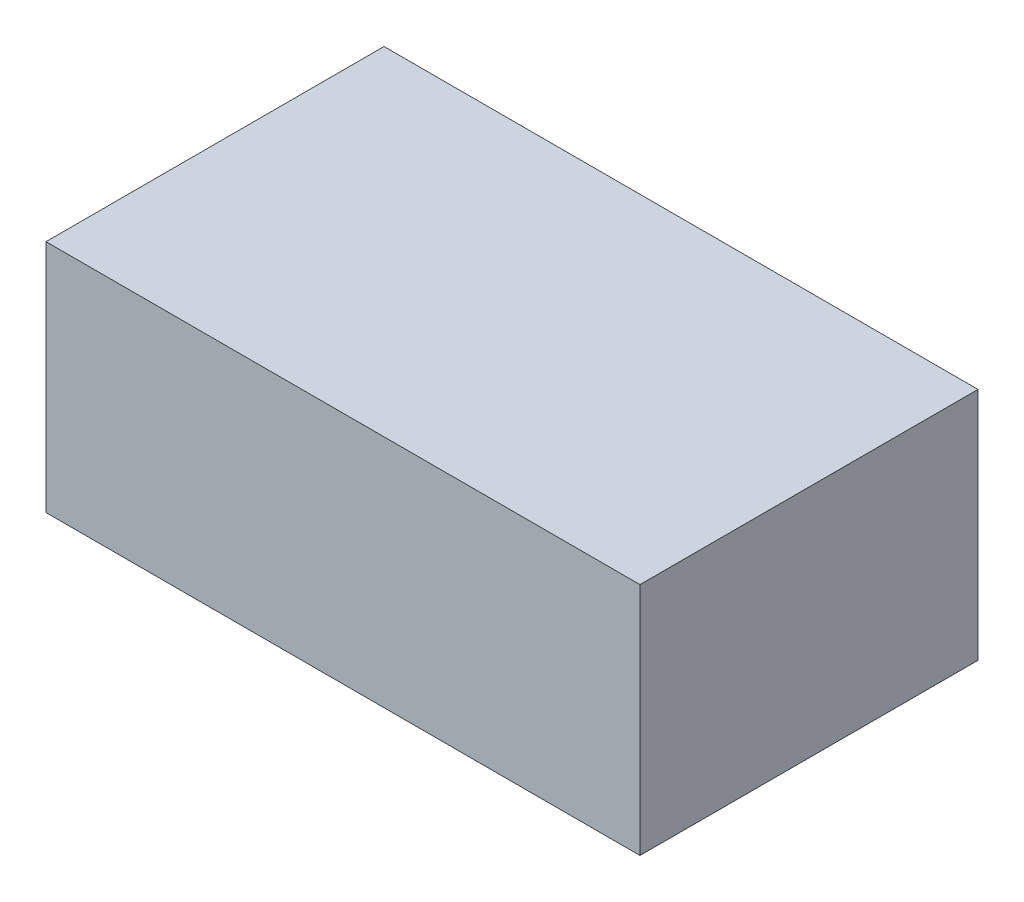
ISO-10303-21;
HEADER;
FILE_DESCRIPTION(('STEP AP214'),'2;1');
FILE_NAME('part.step','',(''),(''),'','','');
FILE_SCHEMA(('AUTOMOTIVE_DESIGN { 1 0 10303 214 1 1 1 1 }'));
ENDSEC;
DATA;
#1=APPLICATION_CONTEXT('core data for automotive mechanical design processes');
#2=APPLICATION_PROTOCOL_DEFINITION('international standard','automotive_design',2000,#1);
#3=PRODUCT_CONTEXT('',#1,'mechanical');
#4=PRODUCT('Part','Part','',(#3));
#5=PRODUCT_RELATED_PRODUCT_CATEGORY('part','',(#4));
#6=PRODUCT_DEFINITION_FORMATION('','',#4);
#7=PRODUCT_DEFINITION_CONTEXT('part definition',#1,'design');
#8=PRODUCT_DEFINITION('design','',#6,#7);
#9=PRODUCT_DEFINITION_SHAPE('','',#8);
#10=(LENGTH_UNIT() NAMED_UNIT(*) SI_UNIT(.MILLI.,.METRE.));
#11=(NAMED_UNIT(*) PLANE_ANGLE_UNIT() SI_UNIT($,.RADIAN.));
#12=(NAMED_UNIT(*) SI_UNIT($,.STERADIAN.) SOLID_ANGLE_UNIT());
#13=UNCERTAINTY_MEASURE_WITH_UNIT(LENGTH_MEASURE(1.E-05),#10,'distance_accuracy_value','');
#14=(GEOMETRIC_REPRESENTATION_CONTEXT(3) GLOBAL_UNCERTAINTY_ASSIGNED_CONTEXT((#13)) GLOBAL_UNIT_ASSIGNED_CONTEXT((#10,
#11,#12)) REPRESENTATION_CONTEXT('',''));
#15=CARTESIAN_POINT('',(0.,0.,0.));
#16=DIRECTION('',(0.,0.,1.));
#17=DIRECTION('',(1.,0.,0.));
#18=AXIS2_PLACEMENT_3D('',#15,#16,#17);
#19=CARTESIAN_POINT('',(0.,22.,0.));
#20=DIRECTION('',(1.,0.,0.));
#21=DIRECTION('',(0.,0.,-1.));
#22=AXIS2_PLACEMENT_3D('',#19,#20,#21);
#23=PLANE('',#22);
#24=DIRECTION('',(0.,0.,1.));
#25=VECTOR('',#24,1.);
#26=CARTESIAN_POINT('',(0.,0.,0.));
#27=LINE('',#26,#25);
#28=CARTESIAN_POINT('',(0.,0.,-31.7));
#29=VERTEX_POINT('',#28);
#30=CARTESIAN_POINT('',(0.,0.,0.));
#31=VERTEX_POINT('',#30);
#32=EDGE_CURVE('E158',#29,#31,#27,.T.);
#33=ORIENTED_EDGE('',*,*,#32,.T.);
#34=DIRECTION('',(0.,-1.,0.));
#35=VECTOR('',#34,1.);
#36=CARTESIAN_POINT('',(0.,22.,0.));
#37=LINE('',#36,#35);
#38=CARTESIAN_POINT('',(0.,22.,0.));
#39=VERTEX_POINT('',#38);
#40=EDGE_CURVE('E11',#39,#31,#37,.T.);
#41=ORIENTED_EDGE('',*,*,#40,.F.);
#42=DIRECTION('',(0.,0.,1.));
#43=VECTOR('',#42,1.);
#44=CARTESIAN_POINT('',(0.,22.,0.));
#45=LINE('',#44,#43);
#46=CARTESIAN_POINT('',(0.,22.,-31.7));
#47=VERTEX_POINT('',#46);
#48=EDGE_CURVE('E164',#47,#39,#45,.T.);
#49=ORIENTED_EDGE('',*,*,#48,.F.);
#50=DIRECTION('',(0.,-1.,0.));
#51=VECTOR('',#50,1.);
#52=CARTESIAN_POINT('',(0.,22.,-31.7));
#53=LINE('',#52,#51);
#54=EDGE_CURVE('E174',#47,#29,#53,.T.);
#55=ORIENTED_EDGE('',*,*,#54,.T.);
#56=EDGE_LOOP('',(#33,#41,#49,#55));
#57=FACE_BOUND('',#56,.T.);
#58=ADVANCED_FACE('F39',(#57),#23,.F.);
#59=CARTESIAN_POINT('',(0.,22.,0.));
#60=DIRECTION('',(0.,0.,-1.));
#61=DIRECTION('',(-1.,0.,0.));
#62=AXIS2_PLACEMENT_3D('',#59,#60,#61);
#63=PLANE('',#62);
#64=DIRECTION('',(1.,0.,0.));
#65=VECTOR('',#64,1.);
#66=CARTESIAN_POINT('',(0.,0.,0.));
#67=LINE('',#66,#65);
#68=CARTESIAN_POINT('',(55.7,0.,0.));
#69=VERTEX_POINT('',#68);
#70=EDGE_CURVE('E178',#31,#69,#67,.T.);
#71=ORIENTED_EDGE('',*,*,#70,.T.);
#72=DIRECTION('',(0.,-1.,0.));
#73=VECTOR('',#72,1.);
#74=CARTESIAN_POINT('',(55.7,22.,0.));
#75=LINE('',#74,#73);
#76=CARTESIAN_POINT('',(55.7,22.,0.));
#77=VERTEX_POINT('',#76);
#78=EDGE_CURVE('E47',#77,#69,#75,.T.);
#79=ORIENTED_EDGE('',*,*,#78,.F.);
#80=DIRECTION('',(1.,0.,0.));
#81=VECTOR('',#80,1.);
#82=CARTESIAN_POINT('',(0.,22.,0.));
#83=LINE('',#82,#81);
#84=EDGE_CURVE('E91',#39,#77,#83,.T.);
#85=ORIENTED_EDGE('',*,*,#84,.F.);
#86=ORIENTED_EDGE('',*,*,#40,.T.);
#87=EDGE_LOOP('',(#71,#79,#85,#86));
#88=FACE_BOUND('',#87,.T.);
#89=ADVANCED_FACE('F212',(#88),#63,.F.);
#90=CARTESIAN_POINT('',(55.7,22.,0.));
#91=DIRECTION('',(-1.,0.,0.));
#92=DIRECTION('',(0.,0.,1.));
#93=AXIS2_PLACEMENT_3D('',#90,#91,#92);
#94=PLANE('',#93);
#95=DIRECTION('',(0.,0.,-1.));
#96=VECTOR('',#95,1.);
#97=CARTESIAN_POINT('',(55.7,0.,0.));
#98=LINE('',#97,#96);
#99=CARTESIAN_POINT('',(55.7,0.,-31.7));
#100=VERTEX_POINT('',#99);
#101=EDGE_CURVE('E181',#69,#100,#98,.T.);
#102=ORIENTED_EDGE('',*,*,#101,.T.);
#103=DIRECTION('',(0.,-1.,0.));
#104=VECTOR('',#103,1.);
#105=CARTESIAN_POINT('',(55.7,22.,-31.7));
#106=LINE('',#105,#104);
#107=CARTESIAN_POINT('',(55.7,22.,-31.7));
#108=VERTEX_POINT('',#107);
#109=EDGE_CURVE('E188',#108,#100,#106,.T.);
#110=ORIENTED_EDGE('',*,*,#109,.F.);
#111=DIRECTION('',(0.,0.,-1.));
#112=VECTOR('',#111,1.);
#113=CARTESIAN_POINT('',(55.7,22.,0.));
#114=LINE('',#113,#112);
#115=EDGE_CURVE('E169',#77,#108,#114,.T.);
#116=ORIENTED_EDGE('',*,*,#115,.F.);
#117=ORIENTED_EDGE('',*,*,#78,.T.);
#118=EDGE_LOOP('',(#102,#110,#116,#117));
#119=FACE_BOUND('',#118,.T.);
#120=ADVANCED_FACE('F195',(#119),#94,.F.);
#121=CARTESIAN_POINT('',(0.,22.,-31.7));
#122=DIRECTION('',(0.,0.,1.));
#123=DIRECTION('',(1.,0.,0.));
#124=AXIS2_PLACEMENT_3D('',#121,#122,#123);
#125=PLANE('',#124);
#126=DIRECTION('',(-1.,0.,0.));
#127=VECTOR('',#126,1.);
#128=CARTESIAN_POINT('',(0.,0.,-31.7));
#129=LINE('',#128,#127);
#130=EDGE_CURVE('E84',#100,#29,#129,.T.);
#131=ORIENTED_EDGE('',*,*,#130,.T.);
#132=ORIENTED_EDGE('',*,*,#54,.F.);
#133=DIRECTION('',(-1.,0.,0.));
#134=VECTOR('',#133,1.);
#135=CARTESIAN_POINT('',(0.,22.,-31.7));
#136=LINE('',#135,#134);
#137=EDGE_CURVE('E63',#108,#47,#136,.T.);
#138=ORIENTED_EDGE('',*,*,#137,.F.);
#139=ORIENTED_EDGE('',*,*,#109,.T.);
#140=EDGE_LOOP('',(#131,#132,#138,#139));
#141=FACE_BOUND('',#140,.T.);
#142=ADVANCED_FACE('F203',(#141),#125,.F.);
#143=CARTESIAN_POINT('',(0.,22.,0.));
#144=DIRECTION('',(0.,-1.,0.));
#145=DIRECTION('',(0.,0.,-1.));
#146=AXIS2_PLACEMENT_3D('',#143,#144,#145);
#147=PLANE('',#146);
#148=ORIENTED_EDGE('',*,*,#48,.T.);
#149=ORIENTED_EDGE('',*,*,#84,.T.);
#150=ORIENTED_EDGE('',*,*,#115,.T.);
#151=ORIENTED_EDGE('',*,*,#137,.T.);
#152=EDGE_LOOP('',(#148,#149,#150,#151));
#153=FACE_BOUND('',#152,.T.);
#154=ADVANCED_FACE('F205',(#153),#147,.F.);
#155=CARTESIAN_POINT('',(0.,0.,0.));
#156=DIRECTION('',(0.,-1.,0.));
#157=DIRECTION('',(0.,0.,-1.));
#158=AXIS2_PLACEMENT_3D('',#155,#156,#157);
#159=PLANE('',#158);
#160=DIRECTION('',(0.,0.,-1.));
#161=VECTOR('',#160,1.);
#162=CARTESIAN_POINT('',(2.,0.,-2.));
#163=LINE('',#162,#161);
#164=CARTESIAN_POINT('',(2.,0.,-2.));
#165=VERTEX_POINT('',#164);
#166=CARTESIAN_POINT('',(2.,0.,-29.7));
#167=VERTEX_POINT('',#166);
#168=EDGE_CURVE('E54',#165,#167,#163,.T.);
#169=ORIENTED_EDGE('',*,*,#168,.F.);
#170=DIRECTION('',(-1.,0.,0.));
#171=VECTOR('',#170,1.);
#172=CARTESIAN_POINT('',(2.,0.,-2.));
#173=LINE('',#172,#171);
#174=CARTESIAN_POINT('',(53.7,0.,-2.));
#175=VERTEX_POINT('',#174);
#176=EDGE_CURVE('E136',#175,#165,#173,.T.);
#177=ORIENTED_EDGE('',*,*,#176,.F.);
#178=DIRECTION('',(0.,0.,1.));
#179=VECTOR('',#178,1.);
#180=CARTESIAN_POINT('',(53.7,0.,-2.));
#181=LINE('',#180,#179);
#182=CARTESIAN_POINT('',(53.7,0.,-29.7));
#183=VERTEX_POINT('',#182);
#184=EDGE_CURVE('E140',#183,#175,#181,.T.);
#185=ORIENTED_EDGE('',*,*,#184,.F.);
#186=DIRECTION('',(1.,0.,0.));
#187=VECTOR('',#186,1.);
#188=CARTESIAN_POINT('',(2.,0.,-29.7));
#189=LINE('',#188,#187);
#190=EDGE_CURVE('E149',#167,#183,#189,.T.);
#191=ORIENTED_EDGE('',*,*,#190,.F.);
#192=EDGE_LOOP('',(#169,#177,#185,#191));
#193=FACE_BOUND('',#192,.T.);
#194=ORIENTED_EDGE('',*,*,#32,.F.);
#195=ORIENTED_EDGE('',*,*,#130,.F.);
#196=ORIENTED_EDGE('',*,*,#101,.F.);
#197=ORIENTED_EDGE('',*,*,#70,.F.);
#198=EDGE_LOOP('',(#194,#195,#196,#197));
#199=FACE_BOUND('',#198,.T.);
#200=ADVANCED_FACE('F199',(#193,#199),#159,.T.);
#201=CARTESIAN_POINT('',(2.,20.,-2.));
#202=DIRECTION('',(-1.,0.,0.));
#203=DIRECTION('',(0.,0.,1.));
#204=AXIS2_PLACEMENT_3D('',#201,#202,#203);
#205=PLANE('',#204);
#206=ORIENTED_EDGE('',*,*,#168,.T.);
#207=DIRECTION('',(0.,-1.,0.));
#208=VECTOR('',#207,1.);
#209=CARTESIAN_POINT('',(2.,20.,-29.7));
#210=LINE('',#209,#208);
#211=CARTESIAN_POINT('',(2.,20.,-29.7));
#212=VERTEX_POINT('',#211);
#213=EDGE_CURVE('E111',#212,#167,#210,.T.);
#214=ORIENTED_EDGE('',*,*,#213,.F.);
#215=DIRECTION('',(0.,0.,-1.));
#216=VECTOR('',#215,1.);
#217=CARTESIAN_POINT('',(2.,20.,-2.));
#218=LINE('',#217,#216);
#219=CARTESIAN_POINT('',(2.,20.,-2.));
#220=VERTEX_POINT('',#219);
#221=EDGE_CURVE('E115',#220,#212,#218,.T.);
#222=ORIENTED_EDGE('',*,*,#221,.F.);
#223=DIRECTION('',(0.,-1.,0.));
#224=VECTOR('',#223,1.);
#225=CARTESIAN_POINT('',(2.,20.,-2.));
#226=LINE('',#225,#224);
#227=EDGE_CURVE('E155',#220,#165,#226,.T.);
#228=ORIENTED_EDGE('',*,*,#227,.T.);
#229=EDGE_LOOP('',(#206,#214,#222,#228));
#230=FACE_BOUND('',#229,.T.);
#231=ADVANCED_FACE('F113',(#230),#205,.F.);
#232=CARTESIAN_POINT('',(2.,20.,-2.));
#233=DIRECTION('',(0.,0.,1.));
#234=DIRECTION('',(1.,0.,0.));
#235=AXIS2_PLACEMENT_3D('',#232,#233,#234);
#236=PLANE('',#235);
#237=ORIENTED_EDGE('',*,*,#176,.T.);
#238=ORIENTED_EDGE('',*,*,#227,.F.);
#239=DIRECTION('',(-1.,0.,0.));
#240=VECTOR('',#239,1.);
#241=CARTESIAN_POINT('',(2.,20.,-2.));
#242=LINE('',#241,#240);
#243=CARTESIAN_POINT('',(53.7,20.,-2.));
#244=VERTEX_POINT('',#243);
#245=EDGE_CURVE('E122',#244,#220,#242,.T.);
#246=ORIENTED_EDGE('',*,*,#245,.F.);
#247=DIRECTION('',(0.,-1.,0.));
#248=VECTOR('',#247,1.);
#249=CARTESIAN_POINT('',(53.7,20.,-2.));
#250=LINE('',#249,#248);
#251=EDGE_CURVE('E159',#244,#175,#250,.T.);
#252=ORIENTED_EDGE('',*,*,#251,.T.);
#253=EDGE_LOOP('',(#237,#238,#246,#252));
#254=FACE_BOUND('',#253,.T.);
#255=ADVANCED_FACE('F252',(#254),#236,.F.);
#256=CARTESIAN_POINT('',(53.7,20.,-2.));
#257=DIRECTION('',(1.,0.,0.));
#258=DIRECTION('',(0.,0.,-1.));
#259=AXIS2_PLACEMENT_3D('',#256,#257,#258);
#260=PLANE('',#259);
#261=ORIENTED_EDGE('',*,*,#184,.T.);
#262=ORIENTED_EDGE('',*,*,#251,.F.);
#263=DIRECTION('',(0.,0.,1.));
#264=VECTOR('',#263,1.);
#265=CARTESIAN_POINT('',(53.7,20.,-2.));
#266=LINE('',#265,#264);
#267=CARTESIAN_POINT('',(53.7,20.,-29.7));
#268=VERTEX_POINT('',#267);
#269=EDGE_CURVE('E131',#268,#244,#266,.T.);
#270=ORIENTED_EDGE('',*,*,#269,.F.);
#271=DIRECTION('',(0.,-1.,0.));
#272=VECTOR('',#271,1.);
#273=CARTESIAN_POINT('',(53.7,20.,-29.7));
#274=LINE('',#273,#272);
#275=EDGE_CURVE('E121',#268,#183,#274,.T.);
#276=ORIENTED_EDGE('',*,*,#275,.T.);
#277=EDGE_LOOP('',(#261,#262,#270,#276));
#278=FACE_BOUND('',#277,.T.);
#279=ADVANCED_FACE('F261',(#278),#260,.F.);
#280=CARTESIAN_POINT('',(2.,20.,-29.7));
#281=DIRECTION('',(0.,0.,-1.));
#282=DIRECTION('',(-1.,0.,0.));
#283=AXIS2_PLACEMENT_3D('',#280,#281,#282);
#284=PLANE('',#283);
#285=ORIENTED_EDGE('',*,*,#190,.T.);
#286=ORIENTED_EDGE('',*,*,#275,.F.);
#287=DIRECTION('',(1.,0.,0.));
#288=VECTOR('',#287,1.);
#289=CARTESIAN_POINT('',(2.,20.,-29.7));
#290=LINE('',#289,#288);
#291=EDGE_CURVE('E125',#212,#268,#290,.T.);
#292=ORIENTED_EDGE('',*,*,#291,.F.);
#293=ORIENTED_EDGE('',*,*,#213,.T.);
#294=EDGE_LOOP('',(#285,#286,#292,#293));
#295=FACE_BOUND('',#294,.T.);
#296=ADVANCED_FACE('F126',(#295),#284,.F.);
#297=CARTESIAN_POINT('',(0.,20.,0.));
#298=DIRECTION('',(0.,-1.,0.));
#299=DIRECTION('',(0.,0.,-1.));
#300=AXIS2_PLACEMENT_3D('',#297,#298,#299);
#301=PLANE('',#300);
#302=ORIENTED_EDGE('',*,*,#221,.T.);
#303=ORIENTED_EDGE('',*,*,#291,.T.);
#304=ORIENTED_EDGE('',*,*,#269,.T.);
#305=ORIENTED_EDGE('',*,*,#245,.T.);
#306=EDGE_LOOP('',(#302,#303,#304,#305));
#307=FACE_BOUND('',#306,.T.);
#308=ADVANCED_FACE('F133',(#307),#301,.T.);
#309=CLOSED_SHELL('',(#58,#89,#120,#142,#154,#200,#231,#255,#279,#296,#308));
#310=MANIFOLD_SOLID_BREP('B2',#309);
#311=ADVANCED_BREP_SHAPE_REPRESENTATION('',(#18,#310),#14);
#312=SHAPE_DEFINITION_REPRESENTATION(#9,#311);
ENDSEC;
END-ISO-10303-21;
